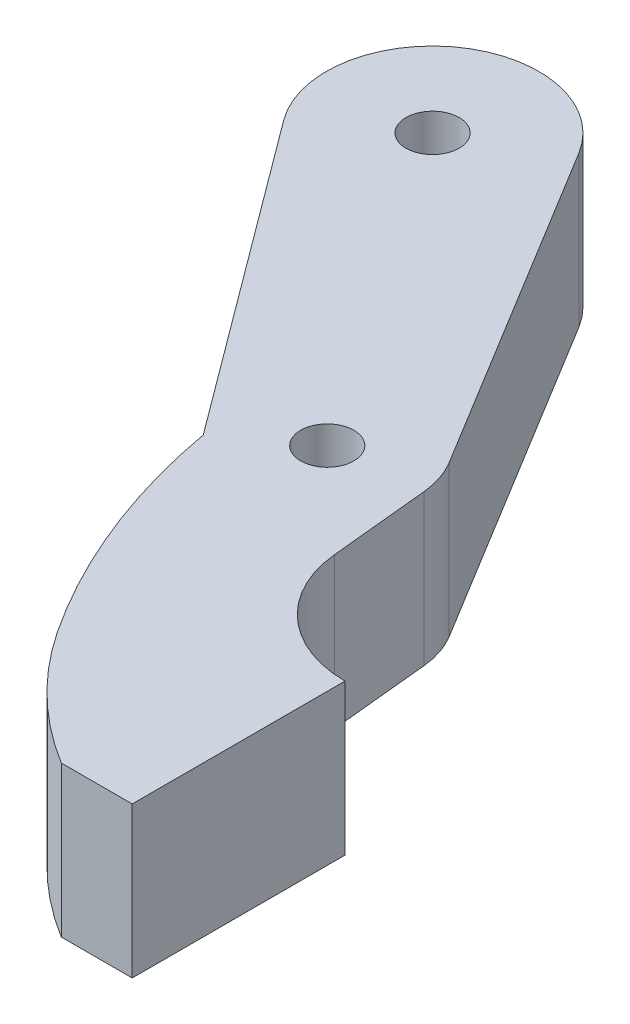
ISO-10303-21;
HEADER;
FILE_DESCRIPTION(('STEP AP214'),'2;1');
FILE_NAME('part.step','',(''),(''),'','','');
FILE_SCHEMA(('AUTOMOTIVE_DESIGN { 1 0 10303 214 1 1 1 1 }'));
ENDSEC;
DATA;
#1=APPLICATION_CONTEXT('core data for automotive mechanical design processes');
#2=APPLICATION_PROTOCOL_DEFINITION('international standard','automotive_design',2000,#1);
#3=PRODUCT_CONTEXT('',#1,'mechanical');
#4=PRODUCT('Part','Part','',(#3));
#5=PRODUCT_RELATED_PRODUCT_CATEGORY('part','',(#4));
#6=PRODUCT_DEFINITION_FORMATION('','',#4);
#7=PRODUCT_DEFINITION_CONTEXT('part definition',#1,'design');
#8=PRODUCT_DEFINITION('design','',#6,#7);
#9=PRODUCT_DEFINITION_SHAPE('','',#8);
#10=(LENGTH_UNIT() NAMED_UNIT(*) SI_UNIT(.MILLI.,.METRE.));
#11=(NAMED_UNIT(*) PLANE_ANGLE_UNIT() SI_UNIT($,.RADIAN.));
#12=(NAMED_UNIT(*) SI_UNIT($,.STERADIAN.) SOLID_ANGLE_UNIT());
#13=UNCERTAINTY_MEASURE_WITH_UNIT(LENGTH_MEASURE(1.E-05),#10,'distance_accuracy_value','');
#14=(GEOMETRIC_REPRESENTATION_CONTEXT(3) GLOBAL_UNCERTAINTY_ASSIGNED_CONTEXT((#13)) GLOBAL_UNIT_ASSIGNED_CONTEXT((#10,
#11,#12)) REPRESENTATION_CONTEXT('',''));
#15=CARTESIAN_POINT('',(0.,0.,0.));
#16=DIRECTION('',(0.,0.,1.));
#17=DIRECTION('',(1.,0.,0.));
#18=AXIS2_PLACEMENT_3D('',#15,#16,#17);
#19=CARTESIAN_POINT('',(-24.3022438763564,8.5,-33.2388265962109));
#20=DIRECTION('',(0.,-1.,0.));
#21=DIRECTION('',(0.,0.,-1.));
#22=AXIS2_PLACEMENT_3D('',#19,#20,#21);
#23=PLANE('',#22);
#24=CARTESIAN_POINT('',(-24.3022438763564,8.5,-33.2388265962109));
#25=DIRECTION('',(0.,1.,0.));
#26=DIRECTION('',(0.,0.,-1.));
#27=AXIS2_PLACEMENT_3D('',#24,#25,#26);
#28=CIRCLE('',#27,6.);
#29=CARTESIAN_POINT('',(-19.1806526051874,8.5,-36.3644149969901));
#30=VERTEX_POINT('',#29);
#31=CARTESIAN_POINT('',(-29.1188208365414,8.5,-29.661035883129));
#32=VERTEX_POINT('',#31);
#33=EDGE_CURVE('E173',#30,#32,#28,.T.);
#34=ORIENTED_EDGE('',*,*,#33,.T.);
#35=DIRECTION('',(0.596298452180319,0.,0.802762826697497));
#36=VECTOR('',#35,1.);
#37=CARTESIAN_POINT('',(-29.1188208365414,8.5,-29.661035883129));
#38=LINE('',#37,#36);
#39=CARTESIAN_POINT('',(-16.0138141334875,8.5,-12.0185077390984));
#40=VERTEX_POINT('',#39);
#41=EDGE_CURVE('E104',#32,#40,#38,.T.);
#42=ORIENTED_EDGE('',*,*,#41,.T.);
#43=CARTESIAN_POINT('',(19.9440463686987,8.5,-18.4746528347855));
#44=DIRECTION('',(0.,1.,0.));
#45=DIRECTION('',(0.,0.,-1.));
#46=AXIS2_PLACEMENT_3D('',#43,#44,#45);
#47=CIRCLE('',#46,36.5328556424384);
#48=CARTESIAN_POINT('',(-10.5,8.5,1.71964294624559));
#49=VERTEX_POINT('',#48);
#50=EDGE_CURVE('E236',#40,#49,#47,.T.);
#51=ORIENTED_EDGE('',*,*,#50,.T.);
#52=CARTESIAN_POINT('',(7.,8.5,-9.88854381999832));
#53=DIRECTION('',(0.,1.,0.));
#54=DIRECTION('',(0.,0.,-1.));
#55=AXIS2_PLACEMENT_3D('',#52,#53,#54);
#56=CIRCLE('',#55,21.);
#57=CARTESIAN_POINT('',(-4.,8.5,8.));
#58=VERTEX_POINT('',#57);
#59=EDGE_CURVE('E206',#49,#58,#56,.T.);
#60=ORIENTED_EDGE('',*,*,#59,.T.);
#61=DIRECTION('',(1.,0.,0.));
#62=VECTOR('',#61,1.);
#63=CARTESIAN_POINT('',(0.,8.5,8.));
#64=LINE('',#63,#62);
#65=CARTESIAN_POINT('',(0.,8.5,8.));
#66=VERTEX_POINT('',#65);
#67=EDGE_CURVE('E201',#58,#66,#64,.T.);
#68=ORIENTED_EDGE('',*,*,#67,.T.);
#69=DIRECTION('',(0.,0.,-1.));
#70=VECTOR('',#69,1.);
#71=CARTESIAN_POINT('',(0.,8.5,-4.));
#72=LINE('',#71,#70);
#73=CARTESIAN_POINT('',(0.,8.5,-4.));
#74=VERTEX_POINT('',#73);
#75=EDGE_CURVE('E205',#66,#74,#72,.T.);
#76=ORIENTED_EDGE('',*,*,#75,.T.);
#77=CARTESIAN_POINT('',(0.,8.5,-10.5));
#78=DIRECTION('',(0.,-1.,0.));
#79=DIRECTION('',(0.,0.,-1.));
#80=AXIS2_PLACEMENT_3D('',#77,#78,#79);
#81=CIRCLE('',#80,6.5);
#82=CARTESIAN_POINT('',(-6.46857221794613,8.5,-9.86158519658809));
#83=VERTEX_POINT('',#82);
#84=EDGE_CURVE('E129',#74,#83,#81,.T.);
#85=ORIENTED_EDGE('',*,*,#84,.T.);
#86=DIRECTION('',(-0.09821766206337,0.,-0.995164956607097));
#87=VECTOR('',#86,1.);
#88=CARTESIAN_POINT('',(-6.46857221794613,8.5,-9.86158519658809));
#89=LINE('',#88,#87);
#90=CARTESIAN_POINT('',(-7.02417521696451,8.5,-15.4910883103168));
#91=VERTEX_POINT('',#90);
#92=EDGE_CURVE('E123',#83,#91,#89,.T.);
#93=ORIENTED_EDGE('',*,*,#92,.T.);
#94=CARTESIAN_POINT('',(-12.0000000000003,8.5,-14.9999999999999));
#95=DIRECTION('',(0.,1.,0.));
#96=DIRECTION('',(0.,0.,1.));
#97=AXIS2_PLACEMENT_3D('',#94,#95,#96);
#98=CIRCLE('',#97,5.0000000000003);
#99=CARTESIAN_POINT('',(-7.73200727402582,8.5,-17.6046570006493));
#100=VERTEX_POINT('',#99);
#101=EDGE_CURVE('E127',#91,#100,#98,.T.);
#102=ORIENTED_EDGE('',*,*,#101,.T.);
#103=DIRECTION('',(-0.520931400129861,0.,-0.853598545194837));
#104=VECTOR('',#103,1.);
#105=CARTESIAN_POINT('',(-19.1806526051874,8.5,-36.3644149969901));
#106=LINE('',#105,#104);
#107=EDGE_CURVE('E55',#100,#30,#106,.T.);
#108=ORIENTED_EDGE('',*,*,#107,.T.);
#109=EDGE_LOOP('',(#34,#42,#51,#60,#68,#76,#85,#93,#102,#108));
#110=FACE_BOUND('',#109,.T.);
#111=CARTESIAN_POINT('',(-24.3022438763564,8.5,-33.2388265962109));
#112=DIRECTION('',(0.,1.,0.));
#113=DIRECTION('',(0.,0.,1.));
#114=AXIS2_PLACEMENT_3D('',#111,#112,#113);
#115=CIRCLE('',#114,1.5);
#116=CARTESIAN_POINT('',(-24.3022438763564,8.5,-31.7388265962109));
#117=VERTEX_POINT('',#116);
#118=EDGE_CURVE('E159',#117,#117,#115,.T.);
#119=ORIENTED_EDGE('',*,*,#118,.F.);
#120=EDGE_LOOP('',(#119));
#121=FACE_BOUND('',#120,.T.);
#122=CARTESIAN_POINT('',(-12.,8.5,-15.));
#123=DIRECTION('',(0.,1.,0.));
#124=DIRECTION('',(0.,0.,1.));
#125=AXIS2_PLACEMENT_3D('',#122,#123,#124);
#126=CIRCLE('',#125,1.5);
#127=CARTESIAN_POINT('',(-12.,8.5,-13.5));
#128=VERTEX_POINT('',#127);
#129=EDGE_CURVE('E172',#128,#128,#126,.T.);
#130=ORIENTED_EDGE('',*,*,#129,.F.);
#131=EDGE_LOOP('',(#130));
#132=FACE_BOUND('',#131,.T.);
#133=ADVANCED_FACE('F37',(#110,#121,#132),#23,.F.);
#134=CARTESIAN_POINT('',(-24.3022438763564,0.,-33.2388265962109));
#135=DIRECTION('',(0.,-1.,0.));
#136=DIRECTION('',(0.,0.,-1.));
#137=AXIS2_PLACEMENT_3D('',#134,#135,#136);
#138=PLANE('',#137);
#139=CARTESIAN_POINT('',(-24.3022438763564,0.,-33.2388265962109));
#140=DIRECTION('',(0.,1.,0.));
#141=DIRECTION('',(0.,0.,1.));
#142=AXIS2_PLACEMENT_3D('',#139,#140,#141);
#143=CIRCLE('',#142,1.5);
#144=CARTESIAN_POINT('',(-24.3022438763564,0.,-31.7388265962109));
#145=VERTEX_POINT('',#144);
#146=EDGE_CURVE('E165',#145,#145,#143,.T.);
#147=ORIENTED_EDGE('',*,*,#146,.T.);
#148=EDGE_LOOP('',(#147));
#149=FACE_BOUND('',#148,.T.);
#150=CARTESIAN_POINT('',(-24.3022438763564,0.,-33.2388265962109));
#151=DIRECTION('',(0.,1.,0.));
#152=DIRECTION('',(0.,0.,-1.));
#153=AXIS2_PLACEMENT_3D('',#150,#151,#152);
#154=CIRCLE('',#153,6.);
#155=CARTESIAN_POINT('',(-19.1806526051874,0.,-36.3644149969901));
#156=VERTEX_POINT('',#155);
#157=CARTESIAN_POINT('',(-29.1188208365414,0.,-29.661035883129));
#158=VERTEX_POINT('',#157);
#159=EDGE_CURVE('E164',#156,#158,#154,.T.);
#160=ORIENTED_EDGE('',*,*,#159,.F.);
#161=DIRECTION('',(-0.520931400129861,0.,-0.853598545194837));
#162=VECTOR('',#161,1.);
#163=CARTESIAN_POINT('',(-19.1806526051874,0.,-36.3644149969901));
#164=LINE('',#163,#162);
#165=CARTESIAN_POINT('',(-7.73200727402582,0.,-17.6046570006493));
#166=VERTEX_POINT('',#165);
#167=EDGE_CURVE('E96',#166,#156,#164,.T.);
#168=ORIENTED_EDGE('',*,*,#167,.F.);
#169=CARTESIAN_POINT('',(-12.0000000000003,0.,-14.9999999999999));
#170=DIRECTION('',(0.,1.,0.));
#171=DIRECTION('',(0.,0.,1.));
#172=AXIS2_PLACEMENT_3D('',#169,#170,#171);
#173=CIRCLE('',#172,5.0000000000003);
#174=CARTESIAN_POINT('',(-7.02417521696451,0.,-15.4910883103168));
#175=VERTEX_POINT('',#174);
#176=EDGE_CURVE('E90',#175,#166,#173,.T.);
#177=ORIENTED_EDGE('',*,*,#176,.F.);
#178=DIRECTION('',(-0.09821766206337,0.,-0.995164956607097));
#179=VECTOR('',#178,1.);
#180=CARTESIAN_POINT('',(-6.46857221794613,0.,-9.86158519658809));
#181=LINE('',#180,#179);
#182=CARTESIAN_POINT('',(-6.46857221794613,0.,-9.86158519658809));
#183=VERTEX_POINT('',#182);
#184=EDGE_CURVE('E137',#183,#175,#181,.T.);
#185=ORIENTED_EDGE('',*,*,#184,.F.);
#186=CARTESIAN_POINT('',(0.,0.,-10.5));
#187=DIRECTION('',(0.,-1.,0.));
#188=DIRECTION('',(0.,0.,-1.));
#189=AXIS2_PLACEMENT_3D('',#186,#187,#188);
#190=CIRCLE('',#189,6.5);
#191=CARTESIAN_POINT('',(0.,0.,-4.));
#192=VERTEX_POINT('',#191);
#193=EDGE_CURVE('E285',#192,#183,#190,.T.);
#194=ORIENTED_EDGE('',*,*,#193,.F.);
#195=DIRECTION('',(0.,0.,-1.));
#196=VECTOR('',#195,1.);
#197=CARTESIAN_POINT('',(0.,0.,-4.));
#198=LINE('',#197,#196);
#199=CARTESIAN_POINT('',(0.,0.,8.));
#200=VERTEX_POINT('',#199);
#201=EDGE_CURVE('E190',#200,#192,#198,.T.);
#202=ORIENTED_EDGE('',*,*,#201,.F.);
#203=DIRECTION('',(1.,0.,0.));
#204=VECTOR('',#203,1.);
#205=CARTESIAN_POINT('',(0.,0.,8.));
#206=LINE('',#205,#204);
#207=CARTESIAN_POINT('',(-4.,0.,8.));
#208=VERTEX_POINT('',#207);
#209=EDGE_CURVE('E185',#208,#200,#206,.T.);
#210=ORIENTED_EDGE('',*,*,#209,.F.);
#211=CARTESIAN_POINT('',(7.,0.,-9.88854381999832));
#212=DIRECTION('',(0.,1.,0.));
#213=DIRECTION('',(0.,0.,-1.));
#214=AXIS2_PLACEMENT_3D('',#211,#212,#213);
#215=CIRCLE('',#214,21.);
#216=CARTESIAN_POINT('',(-10.5,0.,1.71964294624559));
#217=VERTEX_POINT('',#216);
#218=EDGE_CURVE('E181',#217,#208,#215,.T.);
#219=ORIENTED_EDGE('',*,*,#218,.F.);
#220=CARTESIAN_POINT('',(19.9440463686987,0.,-18.4746528347855));
#221=DIRECTION('',(0.,1.,0.));
#222=DIRECTION('',(0.,0.,-1.));
#223=AXIS2_PLACEMENT_3D('',#220,#221,#222);
#224=CIRCLE('',#223,36.5328556424384);
#225=CARTESIAN_POINT('',(-16.0138141334875,0.,-12.0185077390984));
#226=VERTEX_POINT('',#225);
#227=EDGE_CURVE('E186',#226,#217,#224,.T.);
#228=ORIENTED_EDGE('',*,*,#227,.F.);
#229=DIRECTION('',(0.596298452180319,0.,0.802762826697497));
#230=VECTOR('',#229,1.);
#231=CARTESIAN_POINT('',(-29.1188208365414,0.,-29.661035883129));
#232=LINE('',#231,#230);
#233=EDGE_CURVE('E254',#158,#226,#232,.T.);
#234=ORIENTED_EDGE('',*,*,#233,.F.);
#235=EDGE_LOOP('',(#160,#168,#177,#185,#194,#202,#210,#219,#228,#234));
#236=FACE_BOUND('',#235,.T.);
#237=CARTESIAN_POINT('',(-12.,0.,-15.));
#238=DIRECTION('',(0.,1.,0.));
#239=DIRECTION('',(0.,0.,1.));
#240=AXIS2_PLACEMENT_3D('',#237,#238,#239);
#241=CIRCLE('',#240,1.5);
#242=CARTESIAN_POINT('',(-12.,0.,-13.5));
#243=VERTEX_POINT('',#242);
#244=EDGE_CURVE('E166',#243,#243,#241,.T.);
#245=ORIENTED_EDGE('',*,*,#244,.T.);
#246=EDGE_LOOP('',(#245));
#247=FACE_BOUND('',#246,.T.);
#248=ADVANCED_FACE('F270',(#149,#236,#247),#138,.T.);
#249=CARTESIAN_POINT('',(-24.3022438763564,8.5,-33.2388265962109));
#250=DIRECTION('',(0.,-1.,0.));
#251=DIRECTION('',(0.,0.,-1.));
#252=AXIS2_PLACEMENT_3D('',#249,#250,#251);
#253=CYLINDRICAL_SURFACE('',#252,6.);
#254=ORIENTED_EDGE('',*,*,#159,.T.);
#255=DIRECTION('',(0.,-1.,0.));
#256=VECTOR('',#255,1.);
#257=CARTESIAN_POINT('',(-29.1188208365414,8.5,-29.661035883129));
#258=LINE('',#257,#256);
#259=EDGE_CURVE('E12',#32,#158,#258,.T.);
#260=ORIENTED_EDGE('',*,*,#259,.F.);
#261=ORIENTED_EDGE('',*,*,#33,.F.);
#262=DIRECTION('',(0.,-1.,0.));
#263=VECTOR('',#262,1.);
#264=CARTESIAN_POINT('',(-19.1806526051874,8.5,-36.3644149969901));
#265=LINE('',#264,#263);
#266=EDGE_CURVE('E143',#30,#156,#265,.T.);
#267=ORIENTED_EDGE('',*,*,#266,.T.);
#268=EDGE_LOOP('',(#254,#260,#261,#267));
#269=FACE_BOUND('',#268,.T.);
#270=ADVANCED_FACE('F39',(#269),#253,.T.);
#271=CARTESIAN_POINT('',(-29.1188208365414,8.5,-29.661035883129));
#272=DIRECTION('',(0.802762826697497,0.,-0.596298452180319));
#273=DIRECTION('',(-0.596298452180319,0.,-0.802762826697497));
#274=AXIS2_PLACEMENT_3D('',#271,#272,#273);
#275=PLANE('',#274);
#276=ORIENTED_EDGE('',*,*,#233,.T.);
#277=DIRECTION('',(0.,-1.,0.));
#278=VECTOR('',#277,1.);
#279=CARTESIAN_POINT('',(-16.0138141334875,8.5,-12.0185077390984));
#280=LINE('',#279,#278);
#281=EDGE_CURVE('E47',#40,#226,#280,.T.);
#282=ORIENTED_EDGE('',*,*,#281,.F.);
#283=ORIENTED_EDGE('',*,*,#41,.F.);
#284=ORIENTED_EDGE('',*,*,#259,.T.);
#285=EDGE_LOOP('',(#276,#282,#283,#284));
#286=FACE_BOUND('',#285,.T.);
#287=ADVANCED_FACE('F388',(#286),#275,.F.);
#288=CARTESIAN_POINT('',(19.9440463686987,8.5,-18.4746528347855));
#289=DIRECTION('',(0.,-1.,0.));
#290=DIRECTION('',(0.,0.,-1.));
#291=AXIS2_PLACEMENT_3D('',#288,#289,#290);
#292=CYLINDRICAL_SURFACE('',#291,36.5328556424384);
#293=ORIENTED_EDGE('',*,*,#227,.T.);
#294=DIRECTION('',(0.,-1.,0.));
#295=VECTOR('',#294,1.);
#296=CARTESIAN_POINT('',(-10.5,8.5,1.71964294624559));
#297=LINE('',#296,#295);
#298=EDGE_CURVE('E227',#49,#217,#297,.T.);
#299=ORIENTED_EDGE('',*,*,#298,.F.);
#300=ORIENTED_EDGE('',*,*,#50,.F.);
#301=ORIENTED_EDGE('',*,*,#281,.T.);
#302=EDGE_LOOP('',(#293,#299,#300,#301));
#303=FACE_BOUND('',#302,.T.);
#304=ADVANCED_FACE('F260',(#303),#292,.T.);
#305=CARTESIAN_POINT('',(7.,8.5,-9.88854381999832));
#306=DIRECTION('',(0.,-1.,0.));
#307=DIRECTION('',(0.,0.,-1.));
#308=AXIS2_PLACEMENT_3D('',#305,#306,#307);
#309=CYLINDRICAL_SURFACE('',#308,21.);
#310=ORIENTED_EDGE('',*,*,#218,.T.);
#311=DIRECTION('',(0.,-1.,0.));
#312=VECTOR('',#311,1.);
#313=CARTESIAN_POINT('',(-4.,8.5,8.));
#314=LINE('',#313,#312);
#315=EDGE_CURVE('E220',#58,#208,#314,.T.);
#316=ORIENTED_EDGE('',*,*,#315,.F.);
#317=ORIENTED_EDGE('',*,*,#59,.F.);
#318=ORIENTED_EDGE('',*,*,#298,.T.);
#319=EDGE_LOOP('',(#310,#316,#317,#318));
#320=FACE_BOUND('',#319,.T.);
#321=ADVANCED_FACE('F266',(#320),#309,.T.);
#322=CARTESIAN_POINT('',(0.,8.5,8.));
#323=DIRECTION('',(0.,0.,-1.));
#324=DIRECTION('',(-1.,0.,0.));
#325=AXIS2_PLACEMENT_3D('',#322,#323,#324);
#326=PLANE('',#325);
#327=ORIENTED_EDGE('',*,*,#209,.T.);
#328=DIRECTION('',(0.,-1.,0.));
#329=VECTOR('',#328,1.);
#330=CARTESIAN_POINT('',(0.,8.5,8.));
#331=LINE('',#330,#329);
#332=EDGE_CURVE('E217',#66,#200,#331,.T.);
#333=ORIENTED_EDGE('',*,*,#332,.F.);
#334=ORIENTED_EDGE('',*,*,#67,.F.);
#335=ORIENTED_EDGE('',*,*,#315,.T.);
#336=EDGE_LOOP('',(#327,#333,#334,#335));
#337=FACE_BOUND('',#336,.T.);
#338=ADVANCED_FACE('F276',(#337),#326,.F.);
#339=CARTESIAN_POINT('',(0.,8.5,-4.));
#340=DIRECTION('',(-1.,0.,0.));
#341=DIRECTION('',(0.,0.,1.));
#342=AXIS2_PLACEMENT_3D('',#339,#340,#341);
#343=PLANE('',#342);
#344=ORIENTED_EDGE('',*,*,#201,.T.);
#345=DIRECTION('',(0.,-1.,0.));
#346=VECTOR('',#345,1.);
#347=CARTESIAN_POINT('',(0.,8.5,-4.));
#348=LINE('',#347,#346);
#349=EDGE_CURVE('E221',#74,#192,#348,.T.);
#350=ORIENTED_EDGE('',*,*,#349,.F.);
#351=ORIENTED_EDGE('',*,*,#75,.F.);
#352=ORIENTED_EDGE('',*,*,#332,.T.);
#353=EDGE_LOOP('',(#344,#350,#351,#352));
#354=FACE_BOUND('',#353,.T.);
#355=ADVANCED_FACE('F280',(#354),#343,.F.);
#356=CARTESIAN_POINT('',(0.,8.5,-10.5));
#357=DIRECTION('',(0.,-1.,0.));
#358=DIRECTION('',(0.,0.,-1.));
#359=AXIS2_PLACEMENT_3D('',#356,#357,#358);
#360=CYLINDRICAL_SURFACE('',#359,6.5);
#361=ORIENTED_EDGE('',*,*,#193,.T.);
#362=DIRECTION('',(0.,-1.,0.));
#363=VECTOR('',#362,1.);
#364=CARTESIAN_POINT('',(-6.46857221794613,8.5,-9.86158519658809));
#365=LINE('',#364,#363);
#366=EDGE_CURVE('E138',#83,#183,#365,.T.);
#367=ORIENTED_EDGE('',*,*,#366,.F.);
#368=ORIENTED_EDGE('',*,*,#84,.F.);
#369=ORIENTED_EDGE('',*,*,#349,.T.);
#370=EDGE_LOOP('',(#361,#367,#368,#369));
#371=FACE_BOUND('',#370,.T.);
#372=ADVANCED_FACE('F284',(#371),#360,.F.);
#373=CARTESIAN_POINT('',(-6.46857221794613,8.5,-9.86158519658809));
#374=DIRECTION('',(-0.995164956607097,0.,0.09821766206337));
#375=DIRECTION('',(0.09821766206337,0.,0.995164956607097));
#376=AXIS2_PLACEMENT_3D('',#373,#374,#375);
#377=PLANE('',#376);
#378=ORIENTED_EDGE('',*,*,#184,.T.);
#379=DIRECTION('',(0.,-1.,0.));
#380=VECTOR('',#379,1.);
#381=CARTESIAN_POINT('',(-7.02417521696451,8.5,-15.4910883103168));
#382=LINE('',#381,#380);
#383=EDGE_CURVE('E134',#91,#175,#382,.T.);
#384=ORIENTED_EDGE('',*,*,#383,.F.);
#385=ORIENTED_EDGE('',*,*,#92,.F.);
#386=ORIENTED_EDGE('',*,*,#366,.T.);
#387=EDGE_LOOP('',(#378,#384,#385,#386));
#388=FACE_BOUND('',#387,.T.);
#389=ADVANCED_FACE('F135',(#388),#377,.F.);
#390=CARTESIAN_POINT('',(-12.0000000000003,8.5,-14.9999999999999));
#391=DIRECTION('',(0.,-1.,0.));
#392=DIRECTION('',(0.,0.,-1.));
#393=AXIS2_PLACEMENT_3D('',#390,#391,#392);
#394=CYLINDRICAL_SURFACE('',#393,5.0000000000003);
#395=ORIENTED_EDGE('',*,*,#176,.T.);
#396=DIRECTION('',(0.,-1.,0.));
#397=VECTOR('',#396,1.);
#398=CARTESIAN_POINT('',(-7.73200727402582,8.5,-17.6046570006493));
#399=LINE('',#398,#397);
#400=EDGE_CURVE('E139',#100,#166,#399,.T.);
#401=ORIENTED_EDGE('',*,*,#400,.F.);
#402=ORIENTED_EDGE('',*,*,#101,.F.);
#403=ORIENTED_EDGE('',*,*,#383,.T.);
#404=EDGE_LOOP('',(#395,#401,#402,#403));
#405=FACE_BOUND('',#404,.T.);
#406=ADVANCED_FACE('F141',(#405),#394,.T.);
#407=CARTESIAN_POINT('',(-19.1806526051874,8.5,-36.3644149969901));
#408=DIRECTION('',(-0.853598545194837,0.,0.520931400129861));
#409=DIRECTION('',(0.520931400129861,0.,0.853598545194837));
#410=AXIS2_PLACEMENT_3D('',#407,#408,#409);
#411=PLANE('',#410);
#412=ORIENTED_EDGE('',*,*,#167,.T.);
#413=ORIENTED_EDGE('',*,*,#266,.F.);
#414=ORIENTED_EDGE('',*,*,#107,.F.);
#415=ORIENTED_EDGE('',*,*,#400,.T.);
#416=EDGE_LOOP('',(#412,#413,#414,#415));
#417=FACE_BOUND('',#416,.T.);
#418=ADVANCED_FACE('F294',(#417),#411,.F.);
#419=CARTESIAN_POINT('',(-24.3022438763564,8.5,-33.2388265962109));
#420=DIRECTION('',(0.,-1.,0.));
#421=DIRECTION('',(0.,0.,-1.));
#422=AXIS2_PLACEMENT_3D('',#419,#420,#421);
#423=CYLINDRICAL_SURFACE('',#422,1.5);
#424=ORIENTED_EDGE('',*,*,#118,.T.);
#425=EDGE_LOOP('',(#424));
#426=FACE_BOUND('',#425,.T.);
#427=ORIENTED_EDGE('',*,*,#146,.F.);
#428=EDGE_LOOP('',(#427));
#429=FACE_BOUND('',#428,.T.);
#430=ADVANCED_FACE('F296',(#426,#429),#423,.F.);
#431=CARTESIAN_POINT('',(-12.,8.5,-15.));
#432=DIRECTION('',(0.,-1.,0.));
#433=DIRECTION('',(0.,0.,-1.));
#434=AXIS2_PLACEMENT_3D('',#431,#432,#433);
#435=CYLINDRICAL_SURFACE('',#434,1.5);
#436=ORIENTED_EDGE('',*,*,#129,.T.);
#437=EDGE_LOOP('',(#436));
#438=FACE_BOUND('',#437,.T.);
#439=ORIENTED_EDGE('',*,*,#244,.F.);
#440=EDGE_LOOP('',(#439));
#441=FACE_BOUND('',#440,.T.);
#442=ADVANCED_FACE('F302',(#438,#441),#435,.F.);
#443=CLOSED_SHELL('',(#133,#248,#270,#287,#304,#321,#338,#355,#372,#389,#406,#418,#430,#442));
#444=MANIFOLD_SOLID_BREP('B2',#443);
#445=ADVANCED_BREP_SHAPE_REPRESENTATION('',(#18,#444),#14);
#446=SHAPE_DEFINITION_REPRESENTATION(#9,#445);
ENDSEC;
END-ISO-10303-21;
